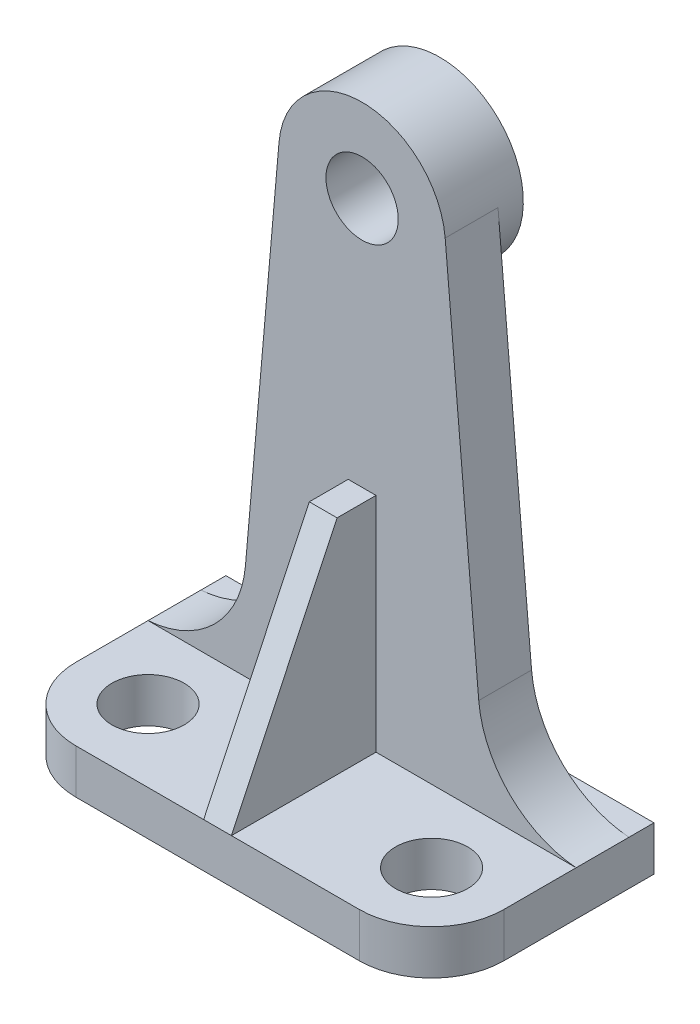
ISO-10303-21;
HEADER;
FILE_DESCRIPTION(('STEP AP214'),'2;1');
FILE_NAME('part.step','',(''),(''),'','','');
FILE_SCHEMA(('AUTOMOTIVE_DESIGN { 1 0 10303 214 1 1 1 1 }'));
ENDSEC;
DATA;
#1=APPLICATION_CONTEXT('core data for automotive mechanical design processes');
#2=APPLICATION_PROTOCOL_DEFINITION('international standard','automotive_design',2000,#1);
#3=PRODUCT_CONTEXT('',#1,'mechanical');
#4=PRODUCT('Part','Part','',(#3));
#5=PRODUCT_RELATED_PRODUCT_CATEGORY('part','',(#4));
#6=PRODUCT_DEFINITION_FORMATION('','',#4);
#7=PRODUCT_DEFINITION_CONTEXT('part definition',#1,'design');
#8=PRODUCT_DEFINITION('design','',#6,#7);
#9=PRODUCT_DEFINITION_SHAPE('','',#8);
#10=(LENGTH_UNIT() NAMED_UNIT(*) SI_UNIT(.MILLI.,.METRE.));
#11=(NAMED_UNIT(*) PLANE_ANGLE_UNIT() SI_UNIT($,.RADIAN.));
#12=(NAMED_UNIT(*) SI_UNIT($,.STERADIAN.) SOLID_ANGLE_UNIT());
#13=UNCERTAINTY_MEASURE_WITH_UNIT(LENGTH_MEASURE(1.E-05),#10,'distance_accuracy_value','');
#14=(GEOMETRIC_REPRESENTATION_CONTEXT(3) GLOBAL_UNCERTAINTY_ASSIGNED_CONTEXT((#13)) GLOBAL_UNIT_ASSIGNED_CONTEXT((#10,
#11,#12)) REPRESENTATION_CONTEXT('',''));
#15=CARTESIAN_POINT('',(0.,0.,0.));
#16=DIRECTION('',(0.,0.,1.));
#17=DIRECTION('',(1.,0.,0.));
#18=AXIS2_PLACEMENT_3D('',#15,#16,#17);
#19=CARTESIAN_POINT('',(-25.5,8.,-13.));
#20=DIRECTION('',(0.,1.,0.));
#21=DIRECTION('',(0.,0.,1.));
#22=AXIS2_PLACEMENT_3D('',#19,#20,#21);
#23=PLANE('',#22);
#24=CARTESIAN_POINT('',(-25.5,8.,-13.));
#25=DIRECTION('',(0.,1.,0.));
#26=DIRECTION('',(0.,0.,1.));
#27=AXIS2_PLACEMENT_3D('',#24,#25,#26);
#28=CIRCLE('',#27,6.5);
#29=CARTESIAN_POINT('',(-25.5,8.,-6.50000000000001));
#30=VERTEX_POINT('',#29);
#31=EDGE_CURVE('E358',#30,#30,#28,.T.);
#32=ORIENTED_EDGE('',*,*,#31,.F.);
#33=EDGE_LOOP('',(#32));
#34=FACE_BOUND('',#33,.T.);
#35=DIRECTION('',(1.,0.,0.));
#36=VECTOR('',#35,1.);
#37=CARTESIAN_POINT('',(-25.4999999999999,8.,0.));
#38=LINE('',#37,#36);
#39=CARTESIAN_POINT('',(-25.4999999999999,8.,0.));
#40=VERTEX_POINT('',#39);
#41=CARTESIAN_POINT('',(-2.5,8.,0.));
#42=VERTEX_POINT('',#41);
#43=EDGE_CURVE('E195',#40,#42,#38,.T.);
#44=ORIENTED_EDGE('',*,*,#43,.T.);
#45=DIRECTION('',(0.,0.,-1.));
#46=VECTOR('',#45,1.);
#47=CARTESIAN_POINT('',(-2.5,8.,0.));
#48=LINE('',#47,#46);
#49=CARTESIAN_POINT('',(-2.5,8.,-26.));
#50=VERTEX_POINT('',#49);
#51=EDGE_CURVE('E278',#42,#50,#48,.T.);
#52=ORIENTED_EDGE('',*,*,#51,.T.);
#53=DIRECTION('',(1.,0.,0.));
#54=VECTOR('',#53,1.);
#55=CARTESIAN_POINT('',(-25.5,8.,-26.));
#56=LINE('',#55,#54);
#57=CARTESIAN_POINT('',(-38.5,8.,-26.));
#58=VERTEX_POINT('',#57);
#59=EDGE_CURVE('E349',#58,#50,#56,.T.);
#60=ORIENTED_EDGE('',*,*,#59,.F.);
#61=DIRECTION('',(0.,0.,1.));
#62=VECTOR('',#61,1.);
#63=CARTESIAN_POINT('',(-38.5,8.,-40.));
#64=LINE('',#63,#62);
#65=CARTESIAN_POINT('',(-38.5,8.,-13.0000000000001));
#66=VERTEX_POINT('',#65);
#67=EDGE_CURVE('E234',#58,#66,#64,.T.);
#68=ORIENTED_EDGE('',*,*,#67,.T.);
#69=CARTESIAN_POINT('',(-25.5,8.,-13.));
#70=DIRECTION('',(0.,1.,0.));
#71=DIRECTION('',(0.,0.,1.));
#72=AXIS2_PLACEMENT_3D('',#69,#70,#71);
#73=CIRCLE('',#72,13.);
#74=EDGE_CURVE('E196',#66,#40,#73,.T.);
#75=ORIENTED_EDGE('',*,*,#74,.T.);
#76=EDGE_LOOP('',(#44,#52,#60,#68,#75));
#77=FACE_BOUND('',#76,.T.);
#78=ADVANCED_FACE('F41',(#34,#77),#23,.T.);
#79=CARTESIAN_POINT('',(-38.5,8.,-40.));
#80=VERTEX_POINT('',#79);
#81=CARTESIAN_POINT('',(-38.5,8.,-35.5));
#82=VERTEX_POINT('',#81);
#83=EDGE_CURVE('E201',#80,#82,#64,.T.);
#84=ORIENTED_EDGE('',*,*,#83,.T.);
#85=DIRECTION('',(1.,0.,0.));
#86=VECTOR('',#85,1.);
#87=CARTESIAN_POINT('',(-25.5,8.,-35.5));
#88=LINE('',#87,#86);
#89=CARTESIAN_POINT('',(38.5,8.,-35.5));
#90=VERTEX_POINT('',#89);
#91=EDGE_CURVE('E65',#82,#90,#88,.T.);
#92=ORIENTED_EDGE('',*,*,#91,.T.);
#93=DIRECTION('',(0.,0.,-1.));
#94=VECTOR('',#93,1.);
#95=CARTESIAN_POINT('',(38.5,8.,-40.));
#96=LINE('',#95,#94);
#97=CARTESIAN_POINT('',(38.5,8.,-40.));
#98=VERTEX_POINT('',#97);
#99=EDGE_CURVE('E207',#90,#98,#96,.T.);
#100=ORIENTED_EDGE('',*,*,#99,.T.);
#101=DIRECTION('',(-1.,0.,0.));
#102=VECTOR('',#101,1.);
#103=CARTESIAN_POINT('',(-38.5,8.,-40.));
#104=LINE('',#103,#102);
#105=EDGE_CURVE('E211',#98,#80,#104,.T.);
#106=ORIENTED_EDGE('',*,*,#105,.T.);
#107=EDGE_LOOP('',(#84,#92,#100,#106));
#108=FACE_BOUND('',#107,.T.);
#109=ADVANCED_FACE('F419',(#108),#23,.T.);
#110=CARTESIAN_POINT('',(-38.5,8.,-40.));
#111=DIRECTION('',(1.,0.,0.));
#112=DIRECTION('',(0.,0.,-1.));
#113=AXIS2_PLACEMENT_3D('',#110,#111,#112);
#114=PLANE('',#113);
#115=ORIENTED_EDGE('',*,*,#67,.F.);
#116=DIRECTION('',(0.,0.,1.));
#117=VECTOR('',#116,1.);
#118=CARTESIAN_POINT('',(-38.5,8.,-35.5));
#119=LINE('',#118,#117);
#120=EDGE_CURVE('E345',#82,#58,#119,.T.);
#121=ORIENTED_EDGE('',*,*,#120,.F.);
#122=ORIENTED_EDGE('',*,*,#83,.F.);
#123=DIRECTION('',(0.,-1.,0.));
#124=VECTOR('',#123,1.);
#125=CARTESIAN_POINT('',(-38.5,8.,-40.));
#126=LINE('',#125,#124);
#127=CARTESIAN_POINT('',(-38.5,0.,-40.));
#128=VERTEX_POINT('',#127);
#129=EDGE_CURVE('E214',#80,#128,#126,.T.);
#130=ORIENTED_EDGE('',*,*,#129,.T.);
#131=DIRECTION('',(0.,0.,1.));
#132=VECTOR('',#131,1.);
#133=CARTESIAN_POINT('',(-38.5,0.,-40.));
#134=LINE('',#133,#132);
#135=CARTESIAN_POINT('',(-38.5,0.,-13.0000000000001));
#136=VERTEX_POINT('',#135);
#137=EDGE_CURVE('E215',#128,#136,#134,.T.);
#138=ORIENTED_EDGE('',*,*,#137,.T.);
#139=DIRECTION('',(0.,-1.,0.));
#140=VECTOR('',#139,1.);
#141=CARTESIAN_POINT('',(-38.5,8.,-13.0000000000001));
#142=LINE('',#141,#140);
#143=EDGE_CURVE('E252',#66,#136,#142,.T.);
#144=ORIENTED_EDGE('',*,*,#143,.F.);
#145=EDGE_LOOP('',(#115,#121,#122,#130,#138,#144));
#146=FACE_BOUND('',#145,.T.);
#147=ADVANCED_FACE('F43',(#146),#114,.F.);
#148=CARTESIAN_POINT('',(-25.5,8.,-13.));
#149=DIRECTION('',(0.,-1.,0.));
#150=DIRECTION('',(0.,0.,-1.));
#151=AXIS2_PLACEMENT_3D('',#148,#149,#150);
#152=CYLINDRICAL_SURFACE('',#151,13.);
#153=CARTESIAN_POINT('',(-25.5,0.,-13.));
#154=DIRECTION('',(0.,1.,0.));
#155=DIRECTION('',(0.,0.,1.));
#156=AXIS2_PLACEMENT_3D('',#153,#154,#155);
#157=CIRCLE('',#156,13.);
#158=CARTESIAN_POINT('',(-25.4999999999999,0.,0.));
#159=VERTEX_POINT('',#158);
#160=EDGE_CURVE('E218',#136,#159,#157,.T.);
#161=ORIENTED_EDGE('',*,*,#160,.T.);
#162=DIRECTION('',(0.,-1.,0.));
#163=VECTOR('',#162,1.);
#164=CARTESIAN_POINT('',(-25.4999999999999,8.,0.));
#165=LINE('',#164,#163);
#166=EDGE_CURVE('E248',#40,#159,#165,.T.);
#167=ORIENTED_EDGE('',*,*,#166,.F.);
#168=ORIENTED_EDGE('',*,*,#74,.F.);
#169=ORIENTED_EDGE('',*,*,#143,.T.);
#170=EDGE_LOOP('',(#161,#167,#168,#169));
#171=FACE_BOUND('',#170,.T.);
#172=ADVANCED_FACE('F378',(#171),#152,.T.);
#173=CARTESIAN_POINT('',(-25.4999999999999,8.,0.));
#174=DIRECTION('',(0.,0.,-1.));
#175=DIRECTION('',(-1.,0.,0.));
#176=AXIS2_PLACEMENT_3D('',#173,#174,#175);
#177=PLANE('',#176);
#178=DIRECTION('',(1.,0.,0.));
#179=VECTOR('',#178,1.);
#180=CARTESIAN_POINT('',(-25.4999999999999,0.,0.));
#181=LINE('',#180,#179);
#182=CARTESIAN_POINT('',(25.4999999999999,0.,0.));
#183=VERTEX_POINT('',#182);
#184=EDGE_CURVE('E222',#159,#183,#181,.T.);
#185=ORIENTED_EDGE('',*,*,#184,.T.);
#186=DIRECTION('',(0.,-1.,0.));
#187=VECTOR('',#186,1.);
#188=CARTESIAN_POINT('',(25.4999999999999,8.,0.));
#189=LINE('',#188,#187);
#190=CARTESIAN_POINT('',(25.4999999999999,8.,0.));
#191=VERTEX_POINT('',#190);
#192=EDGE_CURVE('E192',#191,#183,#189,.T.);
#193=ORIENTED_EDGE('',*,*,#192,.F.);
#194=CARTESIAN_POINT('',(2.5,8.,0.));
#195=VERTEX_POINT('',#194);
#196=EDGE_CURVE('E184',#195,#191,#38,.T.);
#197=ORIENTED_EDGE('',*,*,#196,.F.);
#198=DIRECTION('',(-1.,0.,0.));
#199=VECTOR('',#198,1.);
#200=CARTESIAN_POINT('',(2.5,8.,0.));
#201=LINE('',#200,#199);
#202=EDGE_CURVE('E169',#195,#42,#201,.T.);
#203=ORIENTED_EDGE('',*,*,#202,.T.);
#204=ORIENTED_EDGE('',*,*,#43,.F.);
#205=ORIENTED_EDGE('',*,*,#166,.T.);
#206=EDGE_LOOP('',(#185,#193,#197,#203,#204,#205));
#207=FACE_BOUND('',#206,.T.);
#208=ADVANCED_FACE('F190',(#207),#177,.F.);
#209=CARTESIAN_POINT('',(25.5,8.,-13.));
#210=DIRECTION('',(0.,-1.,0.));
#211=DIRECTION('',(0.,0.,-1.));
#212=AXIS2_PLACEMENT_3D('',#209,#210,#211);
#213=CYLINDRICAL_SURFACE('',#212,13.);
#214=CARTESIAN_POINT('',(25.5,0.,-13.));
#215=DIRECTION('',(0.,1.,0.));
#216=DIRECTION('',(0.,0.,-1.));
#217=AXIS2_PLACEMENT_3D('',#214,#215,#216);
#218=CIRCLE('',#217,13.);
#219=CARTESIAN_POINT('',(38.5,0.,-13.0000000000001));
#220=VERTEX_POINT('',#219);
#221=EDGE_CURVE('E225',#183,#220,#218,.T.);
#222=ORIENTED_EDGE('',*,*,#221,.T.);
#223=DIRECTION('',(0.,-1.,0.));
#224=VECTOR('',#223,1.);
#225=CARTESIAN_POINT('',(38.5,8.,-13.0000000000001));
#226=LINE('',#225,#224);
#227=CARTESIAN_POINT('',(38.5,8.,-13.0000000000001));
#228=VERTEX_POINT('',#227);
#229=EDGE_CURVE('E242',#228,#220,#226,.T.);
#230=ORIENTED_EDGE('',*,*,#229,.F.);
#231=CARTESIAN_POINT('',(25.5,8.,-13.));
#232=DIRECTION('',(0.,1.,0.));
#233=DIRECTION('',(0.,0.,-1.));
#234=AXIS2_PLACEMENT_3D('',#231,#232,#233);
#235=CIRCLE('',#234,13.);
#236=EDGE_CURVE('E200',#191,#228,#235,.T.);
#237=ORIENTED_EDGE('',*,*,#236,.F.);
#238=ORIENTED_EDGE('',*,*,#192,.T.);
#239=EDGE_LOOP('',(#222,#230,#237,#238));
#240=FACE_BOUND('',#239,.T.);
#241=ADVANCED_FACE('F425',(#240),#213,.T.);
#242=CARTESIAN_POINT('',(38.5,8.,-40.));
#243=DIRECTION('',(-1.,0.,0.));
#244=DIRECTION('',(0.,0.,1.));
#245=AXIS2_PLACEMENT_3D('',#242,#243,#244);
#246=PLANE('',#245);
#247=DIRECTION('',(0.,0.,-1.));
#248=VECTOR('',#247,1.);
#249=CARTESIAN_POINT('',(38.5,0.,-40.));
#250=LINE('',#249,#248);
#251=CARTESIAN_POINT('',(38.5,0.,-40.));
#252=VERTEX_POINT('',#251);
#253=EDGE_CURVE('E228',#220,#252,#250,.T.);
#254=ORIENTED_EDGE('',*,*,#253,.T.);
#255=DIRECTION('',(0.,-1.,0.));
#256=VECTOR('',#255,1.);
#257=CARTESIAN_POINT('',(38.5,8.,-40.));
#258=LINE('',#257,#256);
#259=EDGE_CURVE('E238',#98,#252,#258,.T.);
#260=ORIENTED_EDGE('',*,*,#259,.F.);
#261=ORIENTED_EDGE('',*,*,#99,.F.);
#262=DIRECTION('',(0.,0.,1.));
#263=VECTOR('',#262,1.);
#264=CARTESIAN_POINT('',(38.5,8.,-35.5));
#265=LINE('',#264,#263);
#266=CARTESIAN_POINT('',(38.5,8.,-26.));
#267=VERTEX_POINT('',#266);
#268=EDGE_CURVE('E311',#90,#267,#265,.T.);
#269=ORIENTED_EDGE('',*,*,#268,.T.);
#270=EDGE_CURVE('E208',#228,#267,#96,.T.);
#271=ORIENTED_EDGE('',*,*,#270,.F.);
#272=ORIENTED_EDGE('',*,*,#229,.T.);
#273=EDGE_LOOP('',(#254,#260,#261,#269,#271,#272));
#274=FACE_BOUND('',#273,.T.);
#275=ADVANCED_FACE('F415',(#274),#246,.F.);
#276=CARTESIAN_POINT('',(-38.5,8.,-40.));
#277=DIRECTION('',(0.,0.,1.));
#278=DIRECTION('',(1.,0.,0.));
#279=AXIS2_PLACEMENT_3D('',#276,#277,#278);
#280=PLANE('',#279);
#281=DIRECTION('',(-1.,0.,0.));
#282=VECTOR('',#281,1.);
#283=CARTESIAN_POINT('',(-38.5,0.,-40.));
#284=LINE('',#283,#282);
#285=EDGE_CURVE('E231',#252,#128,#284,.T.);
#286=ORIENTED_EDGE('',*,*,#285,.T.);
#287=ORIENTED_EDGE('',*,*,#129,.F.);
#288=ORIENTED_EDGE('',*,*,#105,.F.);
#289=ORIENTED_EDGE('',*,*,#259,.T.);
#290=EDGE_LOOP('',(#286,#287,#288,#289));
#291=FACE_BOUND('',#290,.T.);
#292=ADVANCED_FACE('F421',(#291),#280,.F.);
#293=DIRECTION('',(0.,0.,-1.));
#294=VECTOR('',#293,1.);
#295=CARTESIAN_POINT('',(2.5,8.,0.));
#296=LINE('',#295,#294);
#297=CARTESIAN_POINT('',(2.5,8.,-26.));
#298=VERTEX_POINT('',#297);
#299=EDGE_CURVE('E158',#195,#298,#296,.T.);
#300=ORIENTED_EDGE('',*,*,#299,.F.);
#301=ORIENTED_EDGE('',*,*,#196,.T.);
#302=ORIENTED_EDGE('',*,*,#236,.T.);
#303=ORIENTED_EDGE('',*,*,#270,.T.);
#304=EDGE_CURVE('E187',#298,#267,#56,.T.);
#305=ORIENTED_EDGE('',*,*,#304,.F.);
#306=EDGE_LOOP('',(#300,#301,#302,#303,#305));
#307=FACE_BOUND('',#306,.T.);
#308=CARTESIAN_POINT('',(25.5,8.,-13.));
#309=DIRECTION('',(0.,1.,0.));
#310=DIRECTION('',(0.,0.,-1.));
#311=AXIS2_PLACEMENT_3D('',#308,#309,#310);
#312=CIRCLE('',#311,6.5);
#313=CARTESIAN_POINT('',(25.5,8.,-19.5));
#314=VERTEX_POINT('',#313);
#315=EDGE_CURVE('E354',#314,#314,#312,.T.);
#316=ORIENTED_EDGE('',*,*,#315,.F.);
#317=EDGE_LOOP('',(#316));
#318=FACE_BOUND('',#317,.T.);
#319=ADVANCED_FACE('F182',(#307,#318),#23,.T.);
#320=CARTESIAN_POINT('',(-25.5,0.,-13.));
#321=DIRECTION('',(0.,1.,0.));
#322=DIRECTION('',(0.,0.,1.));
#323=AXIS2_PLACEMENT_3D('',#320,#321,#322);
#324=PLANE('',#323);
#325=CARTESIAN_POINT('',(-25.5,0.,-13.));
#326=DIRECTION('',(0.,1.,0.));
#327=DIRECTION('',(0.,0.,1.));
#328=AXIS2_PLACEMENT_3D('',#325,#326,#327);
#329=CIRCLE('',#328,6.5);
#330=CARTESIAN_POINT('',(-25.5,0.,-6.50000000000001));
#331=VERTEX_POINT('',#330);
#332=EDGE_CURVE('E219',#331,#331,#329,.T.);
#333=ORIENTED_EDGE('',*,*,#332,.T.);
#334=EDGE_LOOP('',(#333));
#335=FACE_BOUND('',#334,.T.);
#336=CARTESIAN_POINT('',(25.5,0.,-13.));
#337=DIRECTION('',(0.,1.,0.));
#338=DIRECTION('',(0.,0.,-1.));
#339=AXIS2_PLACEMENT_3D('',#336,#337,#338);
#340=CIRCLE('',#339,6.5);
#341=CARTESIAN_POINT('',(25.5,0.,-19.5));
#342=VERTEX_POINT('',#341);
#343=EDGE_CURVE('E362',#342,#342,#340,.T.);
#344=ORIENTED_EDGE('',*,*,#343,.T.);
#345=EDGE_LOOP('',(#344));
#346=FACE_BOUND('',#345,.T.);
#347=ORIENTED_EDGE('',*,*,#160,.F.);
#348=ORIENTED_EDGE('',*,*,#137,.F.);
#349=ORIENTED_EDGE('',*,*,#285,.F.);
#350=ORIENTED_EDGE('',*,*,#253,.F.);
#351=ORIENTED_EDGE('',*,*,#221,.F.);
#352=ORIENTED_EDGE('',*,*,#184,.F.);
#353=EDGE_LOOP('',(#347,#348,#349,#350,#351,#352));
#354=FACE_BOUND('',#353,.T.);
#355=ADVANCED_FACE('F385',(#335,#346,#354),#324,.F.);
#356=CARTESIAN_POINT('',(25.5,0.,-13.));
#357=DIRECTION('',(0.,1.,0.));
#358=DIRECTION('',(0.,0.,1.));
#359=AXIS2_PLACEMENT_3D('',#356,#357,#358);
#360=CYLINDRICAL_SURFACE('',#359,6.5);
#361=ORIENTED_EDGE('',*,*,#343,.F.);
#362=EDGE_LOOP('',(#361));
#363=FACE_BOUND('',#362,.T.);
#364=ORIENTED_EDGE('',*,*,#315,.T.);
#365=EDGE_LOOP('',(#364));
#366=FACE_BOUND('',#365,.T.);
#367=ADVANCED_FACE('F448',(#363,#366),#360,.F.);
#368=CARTESIAN_POINT('',(-25.5,0.,-13.));
#369=DIRECTION('',(0.,1.,0.));
#370=DIRECTION('',(0.,0.,1.));
#371=AXIS2_PLACEMENT_3D('',#368,#369,#370);
#372=CYLINDRICAL_SURFACE('',#371,6.5);
#373=ORIENTED_EDGE('',*,*,#332,.F.);
#374=EDGE_LOOP('',(#373));
#375=FACE_BOUND('',#374,.T.);
#376=ORIENTED_EDGE('',*,*,#31,.T.);
#377=EDGE_LOOP('',(#376));
#378=FACE_BOUND('',#377,.T.);
#379=ADVANCED_FACE('F482',(#375,#378),#372,.F.);
#380=CARTESIAN_POINT('',(-39.9087014067012,26.9477059388929,-35.5));
#381=DIRECTION('',(0.,0.,1.));
#382=DIRECTION('',(1.,0.,0.));
#383=AXIS2_PLACEMENT_3D('',#380,#381,#382);
#384=CYLINDRICAL_SURFACE('',#383,19.);
#385=CARTESIAN_POINT('',(-39.9087014067012,26.9477059388929,-26.));
#386=DIRECTION('',(0.,0.,1.));
#387=DIRECTION('',(1.,0.,0.));
#388=AXIS2_PLACEMENT_3D('',#385,#386,#387);
#389=CIRCLE('',#388,19.);
#390=CARTESIAN_POINT('',(-20.981002142958,25.2917468266875,-26.));
#391=VERTEX_POINT('',#390);
#392=EDGE_CURVE('E295',#58,#391,#389,.T.);
#393=ORIENTED_EDGE('',*,*,#392,.T.);
#394=DIRECTION('',(0.,0.,1.));
#395=VECTOR('',#394,1.);
#396=CARTESIAN_POINT('',(-20.981002142958,25.2917468266875,-35.5));
#397=LINE('',#396,#395);
#398=CARTESIAN_POINT('',(-20.981002142958,25.2917468266875,-35.5));
#399=VERTEX_POINT('',#398);
#400=EDGE_CURVE('E341',#399,#391,#397,.T.);
#401=ORIENTED_EDGE('',*,*,#400,.F.);
#402=CARTESIAN_POINT('',(-39.9087014067012,26.9477059388929,-35.5));
#403=DIRECTION('',(0.,0.,1.));
#404=DIRECTION('',(1.,0.,0.));
#405=AXIS2_PLACEMENT_3D('',#402,#403,#404);
#406=CIRCLE('',#405,19.);
#407=EDGE_CURVE('E296',#82,#399,#406,.T.);
#408=ORIENTED_EDGE('',*,*,#407,.F.);
#409=ORIENTED_EDGE('',*,*,#120,.T.);
#410=EDGE_LOOP('',(#393,#401,#408,#409));
#411=FACE_BOUND('',#410,.T.);
#412=ADVANCED_FACE('F392',(#411),#384,.F.);
#413=CARTESIAN_POINT('',(-14.9429204713762,94.3073361412148,-35.5));
#414=DIRECTION('',(0.996194698091746,-0.0871557427476551,0.));
#415=DIRECTION('',(0.0871557427476551,0.996194698091746,0.));
#416=AXIS2_PLACEMENT_3D('',#413,#414,#415);
#417=PLANE('',#416);
#418=DIRECTION('',(0.0871557427476551,0.996194698091746,0.));
#419=VECTOR('',#418,1.);
#420=CARTESIAN_POINT('',(-14.9429204713762,94.3073361412148,-26.));
#421=LINE('',#420,#419);
#422=CARTESIAN_POINT('',(-14.9429204713762,94.3073361412148,-26.));
#423=VERTEX_POINT('',#422);
#424=EDGE_CURVE('E314',#391,#423,#421,.T.);
#425=ORIENTED_EDGE('',*,*,#424,.T.);
#426=DIRECTION('',(0.,0.,1.));
#427=VECTOR('',#426,1.);
#428=CARTESIAN_POINT('',(-14.9429204713762,94.3073361412148,-35.5));
#429=LINE('',#428,#427);
#430=CARTESIAN_POINT('',(-14.9429204713762,94.3073361412148,-35.5));
#431=VERTEX_POINT('',#430);
#432=EDGE_CURVE('E337',#431,#423,#429,.T.);
#433=ORIENTED_EDGE('',*,*,#432,.F.);
#434=DIRECTION('',(0.0871557427476551,0.996194698091746,0.));
#435=VECTOR('',#434,1.);
#436=CARTESIAN_POINT('',(-14.9429204713762,94.3073361412148,-35.5));
#437=LINE('',#436,#435);
#438=EDGE_CURVE('E299',#399,#431,#437,.T.);
#439=ORIENTED_EDGE('',*,*,#438,.F.);
#440=ORIENTED_EDGE('',*,*,#400,.T.);
#441=EDGE_LOOP('',(#425,#433,#439,#440));
#442=FACE_BOUND('',#441,.T.);
#443=ADVANCED_FACE('F396',(#442),#417,.F.);
#444=CARTESIAN_POINT('',(0.,93.,-35.5));
#445=DIRECTION('',(0.,0.,1.));
#446=DIRECTION('',(1.,0.,0.));
#447=AXIS2_PLACEMENT_3D('',#444,#445,#446);
#448=CYLINDRICAL_SURFACE('',#447,15.);
#449=CARTESIAN_POINT('',(0.,93.,-26.));
#450=DIRECTION('',(0.,0.,-1.));
#451=DIRECTION('',(-1.,0.,0.));
#452=AXIS2_PLACEMENT_3D('',#449,#450,#451);
#453=CIRCLE('',#452,15.);
#454=CARTESIAN_POINT('',(14.9429204713762,94.3073361412149,-26.));
#455=VERTEX_POINT('',#454);
#456=EDGE_CURVE('E317',#423,#455,#453,.T.);
#457=ORIENTED_EDGE('',*,*,#456,.T.);
#458=DIRECTION('',(0.,0.,1.));
#459=VECTOR('',#458,1.);
#460=CARTESIAN_POINT('',(14.9429204713762,94.3073361412149,-35.5));
#461=LINE('',#460,#459);
#462=CARTESIAN_POINT('',(14.9429204713762,94.3073361412149,-35.5));
#463=VERTEX_POINT('',#462);
#464=EDGE_CURVE('E333',#463,#455,#461,.T.);
#465=ORIENTED_EDGE('',*,*,#464,.F.);
#466=CARTESIAN_POINT('',(0.,93.,-35.5));
#467=DIRECTION('',(0.,0.,1.));
#468=DIRECTION('',(1.,0.,0.));
#469=AXIS2_PLACEMENT_3D('',#466,#467,#468);
#470=CIRCLE('',#469,15.);
#471=EDGE_CURVE('E256',#463,#431,#470,.F.);
#472=ORIENTED_EDGE('',*,*,#471,.T.);
#473=ORIENTED_EDGE('',*,*,#432,.T.);
#474=EDGE_LOOP('',(#457,#465,#472,#473));
#475=FACE_BOUND('',#474,.T.);
#476=CARTESIAN_POINT('',(0.,93.,-40.));
#477=DIRECTION('',(0.,0.,-1.));
#478=DIRECTION('',(-1.,0.,0.));
#479=AXIS2_PLACEMENT_3D('',#476,#477,#478);
#480=CIRCLE('',#479,15.);
#481=CARTESIAN_POINT('',(-15.,93.,-40.));
#482=VERTEX_POINT('',#481);
#483=EDGE_CURVE('E291',#482,#482,#480,.T.);
#484=ORIENTED_EDGE('',*,*,#483,.F.);
#485=EDGE_LOOP('',(#484));
#486=FACE_BOUND('',#485,.T.);
#487=ADVANCED_FACE('F401',(#475,#486),#448,.T.);
#488=CARTESIAN_POINT('',(14.9429204713762,94.3073361412149,-35.5));
#489=DIRECTION('',(-0.996194698091745,-0.0871557427476622,0.));
#490=DIRECTION('',(0.0871557427476622,-0.996194698091745,0.));
#491=AXIS2_PLACEMENT_3D('',#488,#489,#490);
#492=PLANE('',#491);
#493=DIRECTION('',(0.0871557427476622,-0.996194698091745,0.));
#494=VECTOR('',#493,1.);
#495=CARTESIAN_POINT('',(14.9429204713762,94.3073361412149,-26.));
#496=LINE('',#495,#494);
#497=CARTESIAN_POINT('',(20.9810021429585,25.2917468266873,-26.));
#498=VERTEX_POINT('',#497);
#499=EDGE_CURVE('E320',#455,#498,#496,.T.);
#500=ORIENTED_EDGE('',*,*,#499,.T.);
#501=DIRECTION('',(0.,0.,1.));
#502=VECTOR('',#501,1.);
#503=CARTESIAN_POINT('',(20.9810021429585,25.2917468266873,-35.5));
#504=LINE('',#503,#502);
#505=CARTESIAN_POINT('',(20.9810021429585,25.2917468266873,-35.5));
#506=VERTEX_POINT('',#505);
#507=EDGE_CURVE('E329',#506,#498,#504,.T.);
#508=ORIENTED_EDGE('',*,*,#507,.F.);
#509=DIRECTION('',(0.0871557427476622,-0.996194698091745,0.));
#510=VECTOR('',#509,1.);
#511=CARTESIAN_POINT('',(14.9429204713762,94.3073361412149,-35.5));
#512=LINE('',#511,#510);
#513=EDGE_CURVE('E304',#463,#506,#512,.T.);
#514=ORIENTED_EDGE('',*,*,#513,.F.);
#515=ORIENTED_EDGE('',*,*,#464,.T.);
#516=EDGE_LOOP('',(#500,#508,#514,#515));
#517=FACE_BOUND('',#516,.T.);
#518=ADVANCED_FACE('F407',(#517),#492,.F.);
#519=CARTESIAN_POINT('',(39.9087014067017,26.9477059388929,-35.5));
#520=DIRECTION('',(0.,0.,1.));
#521=DIRECTION('',(1.,0.,0.));
#522=AXIS2_PLACEMENT_3D('',#519,#520,#521);
#523=CYLINDRICAL_SURFACE('',#522,19.);
#524=CARTESIAN_POINT('',(39.9087014067017,26.9477059388929,-26.));
#525=DIRECTION('',(0.,0.,1.));
#526=DIRECTION('',(-1.,0.,0.));
#527=AXIS2_PLACEMENT_3D('',#524,#525,#526);
#528=CIRCLE('',#527,19.);
#529=EDGE_CURVE('E300',#498,#267,#528,.T.);
#530=ORIENTED_EDGE('',*,*,#529,.T.);
#531=ORIENTED_EDGE('',*,*,#268,.F.);
#532=CARTESIAN_POINT('',(39.9087014067017,26.9477059388929,-35.5));
#533=DIRECTION('',(0.,0.,1.));
#534=DIRECTION('',(-1.,0.,0.));
#535=AXIS2_PLACEMENT_3D('',#532,#533,#534);
#536=CIRCLE('',#535,19.);
#537=EDGE_CURVE('E307',#506,#90,#536,.T.);
#538=ORIENTED_EDGE('',*,*,#537,.F.);
#539=ORIENTED_EDGE('',*,*,#507,.T.);
#540=EDGE_LOOP('',(#530,#531,#538,#539));
#541=FACE_BOUND('',#540,.T.);
#542=ADVANCED_FACE('F411',(#541),#523,.F.);
#543=CARTESIAN_POINT('',(-39.9087014067012,26.9477059388929,-35.5));
#544=DIRECTION('',(0.,0.,1.));
#545=DIRECTION('',(1.,0.,0.));
#546=AXIS2_PLACEMENT_3D('',#543,#544,#545);
#547=PLANE('',#546);
#548=ORIENTED_EDGE('',*,*,#537,.T.);
#549=ORIENTED_EDGE('',*,*,#91,.F.);
#550=ORIENTED_EDGE('',*,*,#407,.T.);
#551=ORIENTED_EDGE('',*,*,#438,.T.);
#552=ORIENTED_EDGE('',*,*,#471,.F.);
#553=ORIENTED_EDGE('',*,*,#513,.T.);
#554=EDGE_LOOP('',(#548,#549,#550,#551,#552,#553));
#555=FACE_BOUND('',#554,.T.);
#556=ADVANCED_FACE('F398',(#555),#547,.F.);
#557=CARTESIAN_POINT('',(-39.9087014067012,26.9477059388929,-26.));
#558=DIRECTION('',(0.,0.,1.));
#559=DIRECTION('',(1.,0.,0.));
#560=AXIS2_PLACEMENT_3D('',#557,#558,#559);
#561=PLANE('',#560);
#562=DIRECTION('',(0.,1.,0.));
#563=VECTOR('',#562,1.);
#564=CARTESIAN_POINT('',(2.5,26.9477059388929,-26.));
#565=LINE('',#564,#563);
#566=CARTESIAN_POINT('',(2.5,48.,-26.));
#567=VERTEX_POINT('',#566);
#568=EDGE_CURVE('E11',#298,#567,#565,.T.);
#569=ORIENTED_EDGE('',*,*,#568,.F.);
#570=ORIENTED_EDGE('',*,*,#304,.T.);
#571=ORIENTED_EDGE('',*,*,#529,.F.);
#572=ORIENTED_EDGE('',*,*,#499,.F.);
#573=ORIENTED_EDGE('',*,*,#456,.F.);
#574=ORIENTED_EDGE('',*,*,#424,.F.);
#575=ORIENTED_EDGE('',*,*,#392,.F.);
#576=ORIENTED_EDGE('',*,*,#59,.T.);
#577=DIRECTION('',(0.,1.,0.));
#578=VECTOR('',#577,1.);
#579=CARTESIAN_POINT('',(-2.5,26.9477059388929,-26.));
#580=LINE('',#579,#578);
#581=CARTESIAN_POINT('',(-2.5,48.,-26.));
#582=VERTEX_POINT('',#581);
#583=EDGE_CURVE('E260',#50,#582,#580,.T.);
#584=ORIENTED_EDGE('',*,*,#583,.T.);
#585=DIRECTION('',(1.,0.,0.));
#586=VECTOR('',#585,1.);
#587=CARTESIAN_POINT('',(-39.9087014067012,48.,-26.));
#588=LINE('',#587,#586);
#589=EDGE_CURVE('E50',#582,#567,#588,.T.);
#590=ORIENTED_EDGE('',*,*,#589,.T.);
#591=EDGE_LOOP('',(#569,#570,#571,#572,#573,#574,#575,#576,#584,#590));
#592=FACE_BOUND('',#591,.T.);
#593=CARTESIAN_POINT('',(0.,93.,-26.));
#594=DIRECTION('',(0.,0.,1.));
#595=DIRECTION('',(1.,0.,0.));
#596=AXIS2_PLACEMENT_3D('',#593,#594,#595);
#597=CIRCLE('',#596,6.5);
#598=CARTESIAN_POINT('',(6.5,93.,-26.));
#599=VERTEX_POINT('',#598);
#600=EDGE_CURVE('E287',#599,#599,#597,.T.);
#601=ORIENTED_EDGE('',*,*,#600,.F.);
#602=EDGE_LOOP('',(#601));
#603=FACE_BOUND('',#602,.T.);
#604=ADVANCED_FACE('F266',(#592,#603),#561,.T.);
#605=CARTESIAN_POINT('',(0.,93.,-40.));
#606=DIRECTION('',(0.,0.,-1.));
#607=DIRECTION('',(-1.,0.,0.));
#608=AXIS2_PLACEMENT_3D('',#605,#606,#607);
#609=PLANE('',#608);
#610=CARTESIAN_POINT('',(0.,93.,-40.));
#611=DIRECTION('',(0.,0.,-1.));
#612=DIRECTION('',(-1.,0.,0.));
#613=AXIS2_PLACEMENT_3D('',#610,#611,#612);
#614=CIRCLE('',#613,6.5);
#615=CARTESIAN_POINT('',(-6.5,93.,-40.));
#616=VERTEX_POINT('',#615);
#617=EDGE_CURVE('E177',#616,#616,#614,.T.);
#618=ORIENTED_EDGE('',*,*,#617,.F.);
#619=EDGE_LOOP('',(#618));
#620=FACE_BOUND('',#619,.T.);
#621=ORIENTED_EDGE('',*,*,#483,.T.);
#622=EDGE_LOOP('',(#621));
#623=FACE_BOUND('',#622,.T.);
#624=ADVANCED_FACE('F526',(#620,#623),#609,.T.);
#625=CARTESIAN_POINT('',(0.,93.,0.));
#626=DIRECTION('',(0.,0.,-1.));
#627=DIRECTION('',(-1.,0.,0.));
#628=AXIS2_PLACEMENT_3D('',#625,#626,#627);
#629=CYLINDRICAL_SURFACE('',#628,6.5);
#630=ORIENTED_EDGE('',*,*,#600,.T.);
#631=EDGE_LOOP('',(#630));
#632=FACE_BOUND('',#631,.T.);
#633=ORIENTED_EDGE('',*,*,#617,.T.);
#634=EDGE_LOOP('',(#633));
#635=FACE_BOUND('',#634,.T.);
#636=ADVANCED_FACE('F530',(#632,#635),#629,.F.);
#637=CARTESIAN_POINT('',(2.5,48.,-19.));
#638=DIRECTION('',(0.,-0.429056814568288,-0.90327750435429));
#639=DIRECTION('',(0.,0.90327750435429,-0.429056814568288));
#640=AXIS2_PLACEMENT_3D('',#637,#638,#639);
#641=PLANE('',#640);
#642=DIRECTION('',(0.,-0.90327750435429,0.429056814568288));
#643=VECTOR('',#642,1.);
#644=CARTESIAN_POINT('',(-2.5,48.,-19.));
#645=LINE('',#644,#643);
#646=CARTESIAN_POINT('',(-2.5,48.,-19.));
#647=VERTEX_POINT('',#646);
#648=EDGE_CURVE('E171',#647,#42,#645,.T.);
#649=ORIENTED_EDGE('',*,*,#648,.T.);
#650=ORIENTED_EDGE('',*,*,#202,.F.);
#651=DIRECTION('',(0.,-0.90327750435429,0.429056814568288));
#652=VECTOR('',#651,1.);
#653=CARTESIAN_POINT('',(2.5,48.,-19.));
#654=LINE('',#653,#652);
#655=CARTESIAN_POINT('',(2.5,48.,-19.));
#656=VERTEX_POINT('',#655);
#657=EDGE_CURVE('E154',#656,#195,#654,.T.);
#658=ORIENTED_EDGE('',*,*,#657,.F.);
#659=DIRECTION('',(-1.,0.,0.));
#660=VECTOR('',#659,1.);
#661=CARTESIAN_POINT('',(2.5,48.,-19.));
#662=LINE('',#661,#660);
#663=EDGE_CURVE('E178',#656,#647,#662,.T.);
#664=ORIENTED_EDGE('',*,*,#663,.T.);
#665=EDGE_LOOP('',(#649,#650,#658,#664));
#666=FACE_BOUND('',#665,.T.);
#667=ADVANCED_FACE('F170',(#666),#641,.F.);
#668=CARTESIAN_POINT('',(2.5,48.,-35.5));
#669=DIRECTION('',(0.,-1.,0.));
#670=DIRECTION('',(0.,0.,-1.));
#671=AXIS2_PLACEMENT_3D('',#668,#669,#670);
#672=PLANE('',#671);
#673=ORIENTED_EDGE('',*,*,#589,.F.);
#674=DIRECTION('',(0.,0.,1.));
#675=VECTOR('',#674,1.);
#676=CARTESIAN_POINT('',(-2.5,48.,-35.5));
#677=LINE('',#676,#675);
#678=EDGE_CURVE('E57',#582,#647,#677,.T.);
#679=ORIENTED_EDGE('',*,*,#678,.T.);
#680=ORIENTED_EDGE('',*,*,#663,.F.);
#681=DIRECTION('',(0.,0.,1.));
#682=VECTOR('',#681,1.);
#683=CARTESIAN_POINT('',(2.5,48.,-35.5));
#684=LINE('',#683,#682);
#685=EDGE_CURVE('E161',#567,#656,#684,.T.);
#686=ORIENTED_EDGE('',*,*,#685,.F.);
#687=EDGE_LOOP('',(#673,#679,#680,#686));
#688=FACE_BOUND('',#687,.T.);
#689=ADVANCED_FACE('F270',(#688),#672,.F.);
#690=CARTESIAN_POINT('',(2.5,0.,0.));
#691=DIRECTION('',(1.,0.,0.));
#692=DIRECTION('',(0.,0.,-1.));
#693=AXIS2_PLACEMENT_3D('',#690,#691,#692);
#694=PLANE('',#693);
#695=ORIENTED_EDGE('',*,*,#299,.T.);
#696=ORIENTED_EDGE('',*,*,#568,.T.);
#697=ORIENTED_EDGE('',*,*,#685,.T.);
#698=ORIENTED_EDGE('',*,*,#657,.T.);
#699=EDGE_LOOP('',(#695,#696,#697,#698));
#700=FACE_BOUND('',#699,.T.);
#701=ADVANCED_FACE('F156',(#700),#694,.T.);
#702=CARTESIAN_POINT('',(-2.5,0.,0.));
#703=DIRECTION('',(1.,0.,0.));
#704=DIRECTION('',(0.,0.,-1.));
#705=AXIS2_PLACEMENT_3D('',#702,#703,#704);
#706=PLANE('',#705);
#707=ORIENTED_EDGE('',*,*,#583,.F.);
#708=ORIENTED_EDGE('',*,*,#51,.F.);
#709=ORIENTED_EDGE('',*,*,#648,.F.);
#710=ORIENTED_EDGE('',*,*,#678,.F.);
#711=EDGE_LOOP('',(#707,#708,#709,#710));
#712=FACE_BOUND('',#711,.T.);
#713=ADVANCED_FACE('F599',(#712),#706,.F.);
#714=CLOSED_SHELL('',(#78,#109,#147,#172,#208,#241,#275,#292,#319,#355,#367,#379,#412,#443,#487,
#518,#542,#556,#604,#624,#636,#667,#689,#701,#713));
#715=MANIFOLD_SOLID_BREP('B2',#714);
#716=ADVANCED_BREP_SHAPE_REPRESENTATION('',(#18,#715),#14);
#717=SHAPE_DEFINITION_REPRESENTATION(#9,#716);
ENDSEC;
END-ISO-10303-21;
